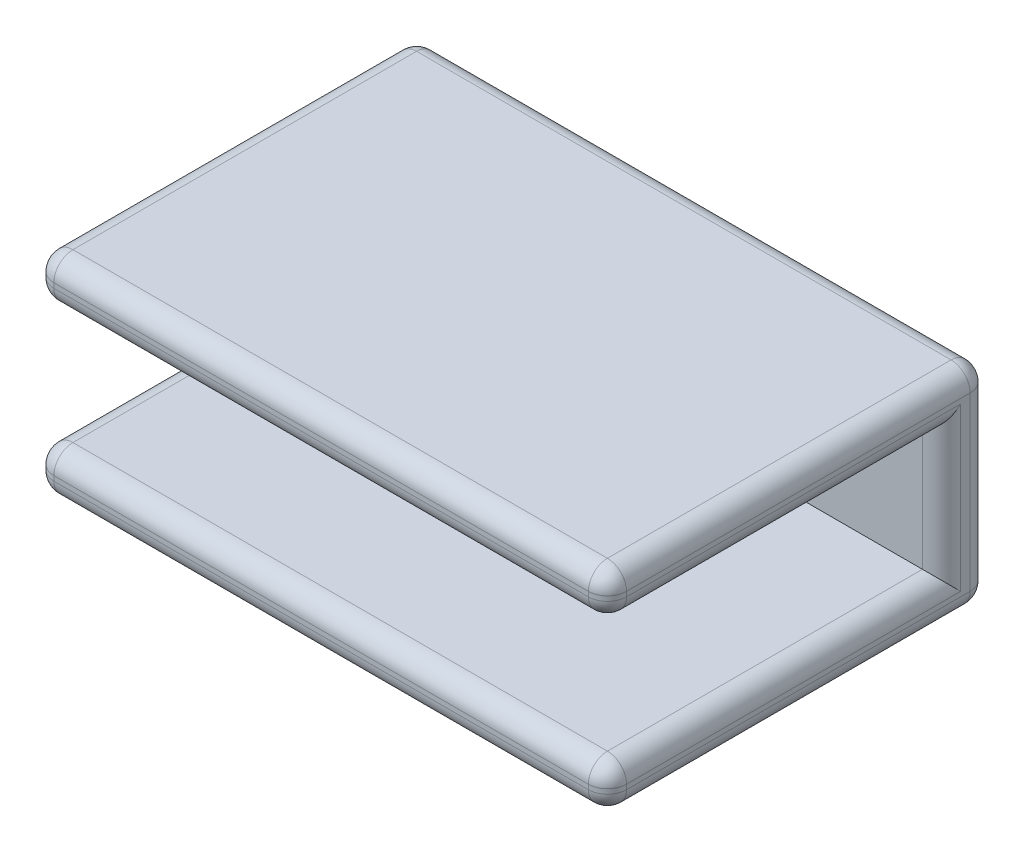
ISO-10303-21;
HEADER;
FILE_DESCRIPTION(('STEP AP214'),'2;1');
FILE_NAME('part.step','',(''),(''),'','','');
FILE_SCHEMA(('AUTOMOTIVE_DESIGN { 1 0 10303 214 1 1 1 1 }'));
ENDSEC;
DATA;
#1=APPLICATION_CONTEXT('core data for automotive mechanical design processes');
#2=APPLICATION_PROTOCOL_DEFINITION('international standard','automotive_design',2000,#1);
#3=PRODUCT_CONTEXT('',#1,'mechanical');
#4=PRODUCT('Part','Part','',(#3));
#5=PRODUCT_RELATED_PRODUCT_CATEGORY('part','',(#4));
#6=PRODUCT_DEFINITION_FORMATION('','',#4);
#7=PRODUCT_DEFINITION_CONTEXT('part definition',#1,'design');
#8=PRODUCT_DEFINITION('design','',#6,#7);
#9=PRODUCT_DEFINITION_SHAPE('','',#8);
#10=(LENGTH_UNIT() NAMED_UNIT(*) SI_UNIT(.MILLI.,.METRE.));
#11=(NAMED_UNIT(*) PLANE_ANGLE_UNIT() SI_UNIT($,.RADIAN.));
#12=(NAMED_UNIT(*) SI_UNIT($,.STERADIAN.) SOLID_ANGLE_UNIT());
#13=UNCERTAINTY_MEASURE_WITH_UNIT(LENGTH_MEASURE(1.E-05),#10,'distance_accuracy_value','');
#14=(GEOMETRIC_REPRESENTATION_CONTEXT(3) GLOBAL_UNCERTAINTY_ASSIGNED_CONTEXT((#13)) GLOBAL_UNIT_ASSIGNED_CONTEXT((#10,
#11,#12)) REPRESENTATION_CONTEXT('',''));
#15=CARTESIAN_POINT('',(0.,0.,0.));
#16=DIRECTION('',(0.,0.,1.));
#17=DIRECTION('',(1.,0.,0.));
#18=AXIS2_PLACEMENT_3D('',#15,#16,#17);
#19=CARTESIAN_POINT('',(-15.,11.,10.));
#20=DIRECTION('',(0.,0.,-1.));
#21=DIRECTION('',(-1.,0.,0.));
#22=AXIS2_PLACEMENT_3D('',#19,#20,#21);
#23=PLANE('',#22);
#24=DIRECTION('',(1.,0.,0.));
#25=VECTOR('',#24,1.);
#26=CARTESIAN_POINT('',(-15.,10.,10.));
#27=LINE('',#26,#25);
#28=CARTESIAN_POINT('',(14.,10.,10.));
#29=VERTEX_POINT('',#28);
#30=CARTESIAN_POINT('',(-14.,10.,10.));
#31=VERTEX_POINT('',#30);
#32=EDGE_CURVE('E322',#29,#31,#27,.F.);
#33=ORIENTED_EDGE('',*,*,#32,.T.);
#34=DIRECTION('',(0.,-1.,0.));
#35=VECTOR('',#34,1.);
#36=CARTESIAN_POINT('',(-14.,11.,10.));
#37=LINE('',#36,#35);
#38=CARTESIAN_POINT('',(-14.,9.75,10.));
#39=VERTEX_POINT('',#38);
#40=EDGE_CURVE('E325',#31,#39,#37,.T.);
#41=ORIENTED_EDGE('',*,*,#40,.T.);
#42=DIRECTION('',(-1.,0.,0.));
#43=VECTOR('',#42,1.);
#44=CARTESIAN_POINT('',(-15.,9.75,10.));
#45=LINE('',#44,#43);
#46=CARTESIAN_POINT('',(14.,9.75000000000001,10.));
#47=VERTEX_POINT('',#46);
#48=EDGE_CURVE('E320',#39,#47,#45,.F.);
#49=ORIENTED_EDGE('',*,*,#48,.T.);
#50=DIRECTION('',(0.,-1.,0.));
#51=VECTOR('',#50,1.);
#52=CARTESIAN_POINT('',(14.,11.,10.));
#53=LINE('',#52,#51);
#54=EDGE_CURVE('E318',#47,#29,#53,.F.);
#55=ORIENTED_EDGE('',*,*,#54,.T.);
#56=EDGE_LOOP('',(#33,#41,#49,#55));
#57=FACE_BOUND('',#56,.T.);
#58=ADVANCED_FACE('F33',(#57),#23,.F.);
#59=CARTESIAN_POINT('',(15.,11.,-10.));
#60=DIRECTION('',(-1.,0.,0.));
#61=DIRECTION('',(0.,0.,1.));
#62=AXIS2_PLACEMENT_3D('',#59,#60,#61);
#63=PLANE('',#62);
#64=DIRECTION('',(0.,-1.,0.));
#65=VECTOR('',#64,1.);
#66=CARTESIAN_POINT('',(15.,11.,-9.));
#67=LINE('',#66,#65);
#68=CARTESIAN_POINT('',(15.,1.,-9.));
#69=VERTEX_POINT('',#68);
#70=CARTESIAN_POINT('',(15.,10.,-9.));
#71=VERTEX_POINT('',#70);
#72=EDGE_CURVE('E42',#69,#71,#67,.F.);
#73=ORIENTED_EDGE('',*,*,#72,.T.);
#74=DIRECTION('',(0.,0.,-1.));
#75=VECTOR('',#74,1.);
#76=CARTESIAN_POINT('',(15.,10.,10.));
#77=LINE('',#76,#75);
#78=CARTESIAN_POINT('',(15.,10.,9.));
#79=VERTEX_POINT('',#78);
#80=EDGE_CURVE('E11',#71,#79,#77,.F.);
#81=ORIENTED_EDGE('',*,*,#80,.T.);
#82=DIRECTION('',(0.,-1.,0.));
#83=VECTOR('',#82,1.);
#84=CARTESIAN_POINT('',(15.,11.,9.));
#85=LINE('',#84,#83);
#86=CARTESIAN_POINT('',(15.,9.75000000000001,9.));
#87=VERTEX_POINT('',#86);
#88=EDGE_CURVE('E388',#79,#87,#85,.T.);
#89=ORIENTED_EDGE('',*,*,#88,.T.);
#90=DIRECTION('',(0.,0.,1.));
#91=VECTOR('',#90,1.);
#92=CARTESIAN_POINT('',(15.,9.75000000000001,-10.));
#93=LINE('',#92,#91);
#94=CARTESIAN_POINT('',(15.,9.75000000000001,-8.5));
#95=VERTEX_POINT('',#94);
#96=EDGE_CURVE('E390',#87,#95,#93,.F.);
#97=ORIENTED_EDGE('',*,*,#96,.T.);
#98=DIRECTION('',(0.,1.,0.));
#99=VECTOR('',#98,1.);
#100=CARTESIAN_POINT('',(15.,11.,-8.5));
#101=LINE('',#100,#99);
#102=CARTESIAN_POINT('',(15.,1.25,-8.5));
#103=VERTEX_POINT('',#102);
#104=EDGE_CURVE('E392',#95,#103,#101,.F.);
#105=ORIENTED_EDGE('',*,*,#104,.T.);
#106=DIRECTION('',(0.,0.,1.));
#107=VECTOR('',#106,1.);
#108=CARTESIAN_POINT('',(15.,1.25,-10.));
#109=LINE('',#108,#107);
#110=CARTESIAN_POINT('',(15.,1.25,9.));
#111=VERTEX_POINT('',#110);
#112=EDGE_CURVE('E394',#103,#111,#109,.T.);
#113=ORIENTED_EDGE('',*,*,#112,.T.);
#114=DIRECTION('',(0.,-1.,0.));
#115=VECTOR('',#114,1.);
#116=CARTESIAN_POINT('',(15.,11.,9.));
#117=LINE('',#116,#115);
#118=CARTESIAN_POINT('',(15.,1.,9.));
#119=VERTEX_POINT('',#118);
#120=EDGE_CURVE('E396',#111,#119,#117,.T.);
#121=ORIENTED_EDGE('',*,*,#120,.T.);
#122=DIRECTION('',(0.,0.,-1.));
#123=VECTOR('',#122,1.);
#124=CARTESIAN_POINT('',(15.,1.,-10.));
#125=LINE('',#124,#123);
#126=EDGE_CURVE('E53',#119,#69,#125,.T.);
#127=ORIENTED_EDGE('',*,*,#126,.T.);
#128=EDGE_LOOP('',(#73,#81,#89,#97,#105,#113,#121,#127));
#129=FACE_BOUND('',#128,.T.);
#130=ADVANCED_FACE('F437',(#129),#63,.F.);
#131=CARTESIAN_POINT('',(-15.,11.,-10.));
#132=DIRECTION('',(0.,0.,1.));
#133=DIRECTION('',(1.,0.,0.));
#134=AXIS2_PLACEMENT_3D('',#131,#132,#133);
#135=PLANE('',#134);
#136=DIRECTION('',(0.,-1.,0.));
#137=VECTOR('',#136,1.);
#138=CARTESIAN_POINT('',(14.,11.,-10.));
#139=LINE('',#138,#137);
#140=CARTESIAN_POINT('',(14.,10.,-10.));
#141=VERTEX_POINT('',#140);
#142=CARTESIAN_POINT('',(14.,1.,-10.));
#143=VERTEX_POINT('',#142);
#144=EDGE_CURVE('E377',#141,#143,#139,.T.);
#145=ORIENTED_EDGE('',*,*,#144,.T.);
#146=DIRECTION('',(-1.,0.,0.));
#147=VECTOR('',#146,1.);
#148=CARTESIAN_POINT('',(-15.,1.,-10.));
#149=LINE('',#148,#147);
#150=CARTESIAN_POINT('',(-14.,1.,-10.));
#151=VERTEX_POINT('',#150);
#152=EDGE_CURVE('E382',#143,#151,#149,.T.);
#153=ORIENTED_EDGE('',*,*,#152,.T.);
#154=DIRECTION('',(0.,-1.,0.));
#155=VECTOR('',#154,1.);
#156=CARTESIAN_POINT('',(-14.,11.,-10.));
#157=LINE('',#156,#155);
#158=CARTESIAN_POINT('',(-14.,10.,-10.));
#159=VERTEX_POINT('',#158);
#160=EDGE_CURVE('E379',#151,#159,#157,.F.);
#161=ORIENTED_EDGE('',*,*,#160,.T.);
#162=DIRECTION('',(-1.,0.,0.));
#163=VECTOR('',#162,1.);
#164=CARTESIAN_POINT('',(15.,10.,-10.));
#165=LINE('',#164,#163);
#166=EDGE_CURVE('E375',#159,#141,#165,.F.);
#167=ORIENTED_EDGE('',*,*,#166,.T.);
#168=EDGE_LOOP('',(#145,#153,#161,#167));
#169=FACE_BOUND('',#168,.T.);
#170=ADVANCED_FACE('F439',(#169),#135,.F.);
#171=CARTESIAN_POINT('',(-15.,11.,-10.));
#172=DIRECTION('',(1.,0.,0.));
#173=DIRECTION('',(0.,0.,-1.));
#174=AXIS2_PLACEMENT_3D('',#171,#172,#173);
#175=PLANE('',#174);
#176=DIRECTION('',(0.,-1.,0.));
#177=VECTOR('',#176,1.);
#178=CARTESIAN_POINT('',(-15.,11.,9.));
#179=LINE('',#178,#177);
#180=CARTESIAN_POINT('',(-15.,1.,9.));
#181=VERTEX_POINT('',#180);
#182=CARTESIAN_POINT('',(-15.,1.25,9.));
#183=VERTEX_POINT('',#182);
#184=EDGE_CURVE('E370',#181,#183,#179,.F.);
#185=ORIENTED_EDGE('',*,*,#184,.T.);
#186=DIRECTION('',(0.,0.,1.));
#187=VECTOR('',#186,1.);
#188=CARTESIAN_POINT('',(-15.,1.25,-10.));
#189=LINE('',#188,#187);
#190=CARTESIAN_POINT('',(-15.,1.25,-8.5));
#191=VERTEX_POINT('',#190);
#192=EDGE_CURVE('E372',#183,#191,#189,.F.);
#193=ORIENTED_EDGE('',*,*,#192,.T.);
#194=DIRECTION('',(0.,-1.,0.));
#195=VECTOR('',#194,1.);
#196=CARTESIAN_POINT('',(-15.,11.,-8.5));
#197=LINE('',#196,#195);
#198=CARTESIAN_POINT('',(-15.,9.75,-8.5));
#199=VERTEX_POINT('',#198);
#200=EDGE_CURVE('E358',#191,#199,#197,.F.);
#201=ORIENTED_EDGE('',*,*,#200,.T.);
#202=DIRECTION('',(0.,0.,1.));
#203=VECTOR('',#202,1.);
#204=CARTESIAN_POINT('',(-15.,9.75,-10.));
#205=LINE('',#204,#203);
#206=CARTESIAN_POINT('',(-15.,9.75,9.));
#207=VERTEX_POINT('',#206);
#208=EDGE_CURVE('E360',#199,#207,#205,.T.);
#209=ORIENTED_EDGE('',*,*,#208,.T.);
#210=DIRECTION('',(0.,-1.,0.));
#211=VECTOR('',#210,1.);
#212=CARTESIAN_POINT('',(-15.,11.,9.));
#213=LINE('',#212,#211);
#214=CARTESIAN_POINT('',(-15.,10.,9.));
#215=VERTEX_POINT('',#214);
#216=EDGE_CURVE('E362',#207,#215,#213,.F.);
#217=ORIENTED_EDGE('',*,*,#216,.T.);
#218=DIRECTION('',(0.,0.,1.));
#219=VECTOR('',#218,1.);
#220=CARTESIAN_POINT('',(-15.,10.,-10.));
#221=LINE('',#220,#219);
#222=CARTESIAN_POINT('',(-15.,10.,-9.));
#223=VERTEX_POINT('',#222);
#224=EDGE_CURVE('E364',#215,#223,#221,.F.);
#225=ORIENTED_EDGE('',*,*,#224,.T.);
#226=DIRECTION('',(0.,-1.,0.));
#227=VECTOR('',#226,1.);
#228=CARTESIAN_POINT('',(-15.,11.,-9.));
#229=LINE('',#228,#227);
#230=CARTESIAN_POINT('',(-15.,1.,-9.));
#231=VERTEX_POINT('',#230);
#232=EDGE_CURVE('E366',#223,#231,#229,.T.);
#233=ORIENTED_EDGE('',*,*,#232,.T.);
#234=DIRECTION('',(0.,0.,1.));
#235=VECTOR('',#234,1.);
#236=CARTESIAN_POINT('',(-15.,1.,-10.));
#237=LINE('',#236,#235);
#238=EDGE_CURVE('E368',#231,#181,#237,.T.);
#239=ORIENTED_EDGE('',*,*,#238,.T.);
#240=EDGE_LOOP('',(#185,#193,#201,#209,#217,#225,#233,#239));
#241=FACE_BOUND('',#240,.T.);
#242=ADVANCED_FACE('F445',(#241),#175,.F.);
#243=DIRECTION('',(1.,0.,0.));
#244=VECTOR('',#243,1.);
#245=CARTESIAN_POINT('',(-15.,1.25,10.));
#246=LINE('',#245,#244);
#247=CARTESIAN_POINT('',(14.,1.25,10.));
#248=VERTEX_POINT('',#247);
#249=CARTESIAN_POINT('',(-14.,1.25,10.));
#250=VERTEX_POINT('',#249);
#251=EDGE_CURVE('E336',#248,#250,#246,.F.);
#252=ORIENTED_EDGE('',*,*,#251,.T.);
#253=DIRECTION('',(0.,-1.,0.));
#254=VECTOR('',#253,1.);
#255=CARTESIAN_POINT('',(-14.,11.,10.));
#256=LINE('',#255,#254);
#257=CARTESIAN_POINT('',(-14.,1.,10.));
#258=VERTEX_POINT('',#257);
#259=EDGE_CURVE('E341',#250,#258,#256,.T.);
#260=ORIENTED_EDGE('',*,*,#259,.T.);
#261=DIRECTION('',(1.,0.,0.));
#262=VECTOR('',#261,1.);
#263=CARTESIAN_POINT('',(-15.,1.,10.));
#264=LINE('',#263,#262);
#265=CARTESIAN_POINT('',(14.,1.,10.));
#266=VERTEX_POINT('',#265);
#267=EDGE_CURVE('E338',#258,#266,#264,.T.);
#268=ORIENTED_EDGE('',*,*,#267,.T.);
#269=DIRECTION('',(0.,-1.,0.));
#270=VECTOR('',#269,1.);
#271=CARTESIAN_POINT('',(14.,11.,10.));
#272=LINE('',#271,#270);
#273=EDGE_CURVE('E334',#266,#248,#272,.F.);
#274=ORIENTED_EDGE('',*,*,#273,.T.);
#275=EDGE_LOOP('',(#252,#260,#268,#274));
#276=FACE_BOUND('',#275,.T.);
#277=ADVANCED_FACE('F449',(#276),#23,.F.);
#278=CARTESIAN_POINT('',(0.,11.,0.));
#279=DIRECTION('',(0.,1.,0.));
#280=DIRECTION('',(0.,0.,1.));
#281=AXIS2_PLACEMENT_3D('',#278,#279,#280);
#282=PLANE('',#281);
#283=DIRECTION('',(0.,0.,1.));
#284=VECTOR('',#283,1.);
#285=CARTESIAN_POINT('',(-14.,11.,10.));
#286=LINE('',#285,#284);
#287=CARTESIAN_POINT('',(-14.,11.,-9.));
#288=VERTEX_POINT('',#287);
#289=CARTESIAN_POINT('',(-14.,11.,9.));
#290=VERTEX_POINT('',#289);
#291=EDGE_CURVE('E192',#288,#290,#286,.T.);
#292=ORIENTED_EDGE('',*,*,#291,.T.);
#293=DIRECTION('',(1.,0.,0.));
#294=VECTOR('',#293,1.);
#295=CARTESIAN_POINT('',(15.,11.,9.));
#296=LINE('',#295,#294);
#297=CARTESIAN_POINT('',(14.,11.,9.));
#298=VERTEX_POINT('',#297);
#299=EDGE_CURVE('E188',#290,#298,#296,.T.);
#300=ORIENTED_EDGE('',*,*,#299,.T.);
#301=DIRECTION('',(0.,0.,-1.));
#302=VECTOR('',#301,1.);
#303=CARTESIAN_POINT('',(14.,11.,-10.));
#304=LINE('',#303,#302);
#305=CARTESIAN_POINT('',(14.,11.,-9.));
#306=VERTEX_POINT('',#305);
#307=EDGE_CURVE('E182',#298,#306,#304,.T.);
#308=ORIENTED_EDGE('',*,*,#307,.T.);
#309=DIRECTION('',(-1.,0.,0.));
#310=VECTOR('',#309,1.);
#311=CARTESIAN_POINT('',(-15.,11.,-9.));
#312=LINE('',#311,#310);
#313=EDGE_CURVE('E185',#306,#288,#312,.T.);
#314=ORIENTED_EDGE('',*,*,#313,.T.);
#315=EDGE_LOOP('',(#292,#300,#308,#314));
#316=FACE_BOUND('',#315,.T.);
#317=ADVANCED_FACE('F184',(#316),#282,.T.);
#318=CARTESIAN_POINT('',(0.,0.,0.));
#319=DIRECTION('',(0.,1.,0.));
#320=DIRECTION('',(0.,0.,1.));
#321=AXIS2_PLACEMENT_3D('',#318,#319,#320);
#322=PLANE('',#321);
#323=DIRECTION('',(0.,0.,-1.));
#324=VECTOR('',#323,1.);
#325=CARTESIAN_POINT('',(14.,0.,0.));
#326=LINE('',#325,#324);
#327=CARTESIAN_POINT('',(14.,0.,-9.));
#328=VERTEX_POINT('',#327);
#329=CARTESIAN_POINT('',(14.,0.,9.));
#330=VERTEX_POINT('',#329);
#331=EDGE_CURVE('E345',#328,#330,#326,.F.);
#332=ORIENTED_EDGE('',*,*,#331,.T.);
#333=DIRECTION('',(1.,0.,0.));
#334=VECTOR('',#333,1.);
#335=CARTESIAN_POINT('',(0.,0.,9.));
#336=LINE('',#335,#334);
#337=CARTESIAN_POINT('',(-14.,0.,9.));
#338=VERTEX_POINT('',#337);
#339=EDGE_CURVE('E349',#330,#338,#336,.F.);
#340=ORIENTED_EDGE('',*,*,#339,.T.);
#341=DIRECTION('',(0.,0.,1.));
#342=VECTOR('',#341,1.);
#343=CARTESIAN_POINT('',(-14.,0.,0.));
#344=LINE('',#343,#342);
#345=CARTESIAN_POINT('',(-14.,0.,-9.));
#346=VERTEX_POINT('',#345);
#347=EDGE_CURVE('E347',#338,#346,#344,.F.);
#348=ORIENTED_EDGE('',*,*,#347,.T.);
#349=DIRECTION('',(-1.,0.,0.));
#350=VECTOR('',#349,1.);
#351=CARTESIAN_POINT('',(0.,0.,-9.));
#352=LINE('',#351,#350);
#353=EDGE_CURVE('E343',#346,#328,#352,.F.);
#354=ORIENTED_EDGE('',*,*,#353,.T.);
#355=EDGE_LOOP('',(#332,#340,#348,#354));
#356=FACE_BOUND('',#355,.T.);
#357=ADVANCED_FACE('F603',(#356),#322,.F.);
#358=CARTESIAN_POINT('',(-15.,8.75,-7.5));
#359=DIRECTION('',(0.,1.,0.));
#360=DIRECTION('',(-1.,0.,0.));
#361=AXIS2_PLACEMENT_3D('',#358,#359,#360);
#362=PLANE('',#361);
#363=DIRECTION('',(-1.,0.,0.));
#364=VECTOR('',#363,1.);
#365=CARTESIAN_POINT('',(-15.,8.75,9.));
#366=LINE('',#365,#364);
#367=CARTESIAN_POINT('',(14.,8.75000000000001,9.));
#368=VERTEX_POINT('',#367);
#369=CARTESIAN_POINT('',(-14.,8.75,9.));
#370=VERTEX_POINT('',#369);
#371=EDGE_CURVE('E329',#368,#370,#366,.T.);
#372=ORIENTED_EDGE('',*,*,#371,.T.);
#373=DIRECTION('',(0.,0.,1.));
#374=VECTOR('',#373,1.);
#375=CARTESIAN_POINT('',(-14.,8.75,-7.5));
#376=LINE('',#375,#374);
#377=CARTESIAN_POINT('',(-14.,8.75,-7.5));
#378=VERTEX_POINT('',#377);
#379=EDGE_CURVE('E332',#370,#378,#376,.F.);
#380=ORIENTED_EDGE('',*,*,#379,.T.);
#381=DIRECTION('',(-1.,0.,0.));
#382=VECTOR('',#381,1.);
#383=CARTESIAN_POINT('',(-15.,8.75,-7.5));
#384=LINE('',#383,#382);
#385=CARTESIAN_POINT('',(14.,8.75000000000001,-7.5));
#386=VERTEX_POINT('',#385);
#387=EDGE_CURVE('E306',#386,#378,#384,.T.);
#388=ORIENTED_EDGE('',*,*,#387,.F.);
#389=DIRECTION('',(0.,0.,1.));
#390=VECTOR('',#389,1.);
#391=CARTESIAN_POINT('',(14.,8.75000000000001,-7.50000000000001));
#392=LINE('',#391,#390);
#393=EDGE_CURVE('E327',#386,#368,#392,.T.);
#394=ORIENTED_EDGE('',*,*,#393,.T.);
#395=EDGE_LOOP('',(#372,#380,#388,#394));
#396=FACE_BOUND('',#395,.T.);
#397=ADVANCED_FACE('F617',(#396),#362,.F.);
#398=CARTESIAN_POINT('',(-15.,2.25,-7.5));
#399=DIRECTION('',(0.,-1.,0.));
#400=DIRECTION('',(0.,0.,-1.));
#401=AXIS2_PLACEMENT_3D('',#398,#399,#400);
#402=PLANE('',#401);
#403=DIRECTION('',(1.,0.,0.));
#404=VECTOR('',#403,1.);
#405=CARTESIAN_POINT('',(-15.,2.25,-7.5));
#406=LINE('',#405,#404);
#407=CARTESIAN_POINT('',(-14.,2.25,-7.5));
#408=VERTEX_POINT('',#407);
#409=CARTESIAN_POINT('',(14.,2.25,-7.5));
#410=VERTEX_POINT('',#409);
#411=EDGE_CURVE('E203',#408,#410,#406,.T.);
#412=ORIENTED_EDGE('',*,*,#411,.F.);
#413=DIRECTION('',(0.,0.,1.));
#414=VECTOR('',#413,1.);
#415=CARTESIAN_POINT('',(-14.,2.25,-7.5));
#416=LINE('',#415,#414);
#417=CARTESIAN_POINT('',(-14.,2.25,9.));
#418=VERTEX_POINT('',#417);
#419=EDGE_CURVE('E356',#408,#418,#416,.T.);
#420=ORIENTED_EDGE('',*,*,#419,.T.);
#421=DIRECTION('',(1.,0.,0.));
#422=VECTOR('',#421,1.);
#423=CARTESIAN_POINT('',(-15.,2.25,9.));
#424=LINE('',#423,#422);
#425=CARTESIAN_POINT('',(14.,2.25,9.));
#426=VERTEX_POINT('',#425);
#427=EDGE_CURVE('E354',#418,#426,#424,.T.);
#428=ORIENTED_EDGE('',*,*,#427,.T.);
#429=DIRECTION('',(0.,0.,1.));
#430=VECTOR('',#429,1.);
#431=CARTESIAN_POINT('',(14.,2.25,-7.50000000000001));
#432=LINE('',#431,#430);
#433=EDGE_CURVE('E352',#426,#410,#432,.F.);
#434=ORIENTED_EDGE('',*,*,#433,.T.);
#435=EDGE_LOOP('',(#412,#420,#428,#434));
#436=FACE_BOUND('',#435,.T.);
#437=ADVANCED_FACE('F589',(#436),#402,.F.);
#438=CARTESIAN_POINT('',(0.,0.,-7.5));
#439=DIRECTION('',(0.,0.,-1.));
#440=DIRECTION('',(-1.,0.,0.));
#441=AXIS2_PLACEMENT_3D('',#438,#439,#440);
#442=PLANE('',#441);
#443=ORIENTED_EDGE('',*,*,#387,.T.);
#444=DIRECTION('',(0.,-1.,0.));
#445=VECTOR('',#444,1.);
#446=CARTESIAN_POINT('',(-14.,0.,-7.5));
#447=LINE('',#446,#445);
#448=EDGE_CURVE('E386',#378,#408,#447,.T.);
#449=ORIENTED_EDGE('',*,*,#448,.T.);
#450=ORIENTED_EDGE('',*,*,#411,.T.);
#451=DIRECTION('',(0.,1.,0.));
#452=VECTOR('',#451,1.);
#453=CARTESIAN_POINT('',(14.,0.,-7.5));
#454=LINE('',#453,#452);
#455=EDGE_CURVE('E384',#410,#386,#454,.T.);
#456=ORIENTED_EDGE('',*,*,#455,.T.);
#457=EDGE_LOOP('',(#443,#449,#450,#456));
#458=FACE_BOUND('',#457,.T.);
#459=ADVANCED_FACE('F568',(#458),#442,.F.);
#460=CARTESIAN_POINT('',(-14.,11.,9.));
#461=DIRECTION('',(0.,-1.,0.));
#462=DIRECTION('',(0.,0.,-1.));
#463=AXIS2_PLACEMENT_3D('',#460,#461,#462);
#464=CYLINDRICAL_SURFACE('',#463,1.);
#465=CARTESIAN_POINT('',(-14.,1.,9.));
#466=DIRECTION('',(0.,-1.,0.));
#467=DIRECTION('',(0.,0.,-1.));
#468=AXIS2_PLACEMENT_3D('',#465,#466,#467);
#469=CIRCLE('',#468,1.);
#470=EDGE_CURVE('E298',#258,#181,#469,.T.);
#471=ORIENTED_EDGE('',*,*,#470,.F.);
#472=ORIENTED_EDGE('',*,*,#259,.F.);
#473=CARTESIAN_POINT('',(-14.,1.25,9.));
#474=DIRECTION('',(0.,1.,0.));
#475=DIRECTION('',(0.,0.,1.));
#476=AXIS2_PLACEMENT_3D('',#473,#474,#475);
#477=CIRCLE('',#476,1.);
#478=EDGE_CURVE('E300',#183,#250,#477,.T.);
#479=ORIENTED_EDGE('',*,*,#478,.F.);
#480=ORIENTED_EDGE('',*,*,#184,.F.);
#481=EDGE_LOOP('',(#471,#472,#479,#480));
#482=FACE_BOUND('',#481,.T.);
#483=ADVANCED_FACE('F35',(#482),#464,.T.);
#484=CARTESIAN_POINT('',(-15.,1.,9.));
#485=DIRECTION('',(1.,0.,0.));
#486=DIRECTION('',(0.,0.,-1.));
#487=AXIS2_PLACEMENT_3D('',#484,#485,#486);
#488=CYLINDRICAL_SURFACE('',#487,1.);
#489=CARTESIAN_POINT('',(14.,1.,9.));
#490=DIRECTION('',(1.,0.,0.));
#491=DIRECTION('',(0.,0.,-1.));
#492=AXIS2_PLACEMENT_3D('',#489,#490,#491);
#493=CIRCLE('',#492,1.);
#494=EDGE_CURVE('E292',#266,#330,#493,.T.);
#495=ORIENTED_EDGE('',*,*,#494,.F.);
#496=ORIENTED_EDGE('',*,*,#267,.F.);
#497=CARTESIAN_POINT('',(-14.,1.,9.));
#498=DIRECTION('',(-1.,0.,0.));
#499=DIRECTION('',(0.,0.,1.));
#500=AXIS2_PLACEMENT_3D('',#497,#498,#499);
#501=CIRCLE('',#500,1.);
#502=EDGE_CURVE('E295',#338,#258,#501,.T.);
#503=ORIENTED_EDGE('',*,*,#502,.F.);
#504=ORIENTED_EDGE('',*,*,#339,.F.);
#505=EDGE_LOOP('',(#495,#496,#503,#504));
#506=FACE_BOUND('',#505,.T.);
#507=ADVANCED_FACE('F561',(#506),#488,.T.);
#508=CARTESIAN_POINT('',(14.,11.,9.));
#509=DIRECTION('',(0.,-1.,0.));
#510=DIRECTION('',(0.,0.,-1.));
#511=AXIS2_PLACEMENT_3D('',#508,#509,#510);
#512=CYLINDRICAL_SURFACE('',#511,1.);
#513=CARTESIAN_POINT('',(14.,1.25,9.));
#514=DIRECTION('',(0.,1.,0.));
#515=DIRECTION('',(-1.,0.,0.));
#516=AXIS2_PLACEMENT_3D('',#513,#514,#515);
#517=CIRCLE('',#516,1.);
#518=EDGE_CURVE('E287',#248,#111,#517,.T.);
#519=ORIENTED_EDGE('',*,*,#518,.F.);
#520=ORIENTED_EDGE('',*,*,#273,.F.);
#521=CARTESIAN_POINT('',(14.,1.,9.));
#522=DIRECTION('',(0.,-1.,0.));
#523=DIRECTION('',(0.,0.,-1.));
#524=AXIS2_PLACEMENT_3D('',#521,#522,#523);
#525=CIRCLE('',#524,1.);
#526=EDGE_CURVE('E290',#119,#266,#525,.T.);
#527=ORIENTED_EDGE('',*,*,#526,.F.);
#528=ORIENTED_EDGE('',*,*,#120,.F.);
#529=EDGE_LOOP('',(#519,#520,#527,#528));
#530=FACE_BOUND('',#529,.T.);
#531=ADVANCED_FACE('F558',(#530),#512,.T.);
#532=CARTESIAN_POINT('',(-15.,1.25,9.));
#533=DIRECTION('',(1.,0.,0.));
#534=DIRECTION('',(0.,0.,-1.));
#535=AXIS2_PLACEMENT_3D('',#532,#533,#534);
#536=CYLINDRICAL_SURFACE('',#535,1.);
#537=CARTESIAN_POINT('',(-14.,1.25,9.));
#538=DIRECTION('',(-1.,0.,0.));
#539=DIRECTION('',(0.,0.,1.));
#540=AXIS2_PLACEMENT_3D('',#537,#538,#539);
#541=CIRCLE('',#540,1.);
#542=EDGE_CURVE('E37',#250,#418,#541,.T.);
#543=ORIENTED_EDGE('',*,*,#542,.F.);
#544=ORIENTED_EDGE('',*,*,#251,.F.);
#545=CARTESIAN_POINT('',(14.,1.25,9.));
#546=DIRECTION('',(1.,0.,0.));
#547=DIRECTION('',(0.,0.,-1.));
#548=AXIS2_PLACEMENT_3D('',#545,#546,#547);
#549=CIRCLE('',#548,1.);
#550=EDGE_CURVE('E284',#426,#248,#549,.T.);
#551=ORIENTED_EDGE('',*,*,#550,.F.);
#552=ORIENTED_EDGE('',*,*,#427,.F.);
#553=EDGE_LOOP('',(#543,#544,#551,#552));
#554=FACE_BOUND('',#553,.T.);
#555=ADVANCED_FACE('F555',(#554),#536,.T.);
#556=CARTESIAN_POINT('',(-14.,1.25,9.));
#557=DIRECTION('',(0.,0.,1.));
#558=DIRECTION('',(1.,0.,0.));
#559=AXIS2_PLACEMENT_3D('',#556,#557,#558);
#560=SPHERICAL_SURFACE('',#559,1.);
#561=ORIENTED_EDGE('',*,*,#478,.T.);
#562=ORIENTED_EDGE('',*,*,#542,.T.);
#563=CARTESIAN_POINT('',(-14.,1.25,9.));
#564=DIRECTION('',(0.,0.,1.));
#565=DIRECTION('',(1.,0.,0.));
#566=AXIS2_PLACEMENT_3D('',#563,#564,#565);
#567=CIRCLE('',#566,1.);
#568=EDGE_CURVE('E281',#183,#418,#567,.F.);
#569=ORIENTED_EDGE('',*,*,#568,.F.);
#570=EDGE_LOOP('',(#561,#562,#569));
#571=FACE_BOUND('',#570,.T.);
#572=ADVANCED_FACE('F551',(#571),#560,.T.);
#573=CARTESIAN_POINT('',(-14.,1.,9.));
#574=DIRECTION('',(0.,0.,1.));
#575=DIRECTION('',(1.,0.,0.));
#576=AXIS2_PLACEMENT_3D('',#573,#574,#575);
#577=SPHERICAL_SURFACE('',#576,1.);
#578=ORIENTED_EDGE('',*,*,#502,.T.);
#579=ORIENTED_EDGE('',*,*,#470,.T.);
#580=CARTESIAN_POINT('',(-14.,1.,9.));
#581=DIRECTION('',(0.,0.,1.));
#582=DIRECTION('',(1.,0.,0.));
#583=AXIS2_PLACEMENT_3D('',#580,#581,#582);
#584=CIRCLE('',#583,1.);
#585=EDGE_CURVE('E278',#338,#181,#584,.F.);
#586=ORIENTED_EDGE('',*,*,#585,.F.);
#587=EDGE_LOOP('',(#578,#579,#586));
#588=FACE_BOUND('',#587,.T.);
#589=ADVANCED_FACE('F547',(#588),#577,.T.);
#590=CARTESIAN_POINT('',(14.,1.,9.));
#591=DIRECTION('',(0.,0.,1.));
#592=DIRECTION('',(1.,0.,0.));
#593=AXIS2_PLACEMENT_3D('',#590,#591,#592);
#594=SPHERICAL_SURFACE('',#593,1.);
#595=ORIENTED_EDGE('',*,*,#526,.T.);
#596=ORIENTED_EDGE('',*,*,#494,.T.);
#597=CARTESIAN_POINT('',(14.,1.,9.));
#598=DIRECTION('',(0.,0.,1.));
#599=DIRECTION('',(1.,0.,0.));
#600=AXIS2_PLACEMENT_3D('',#597,#598,#599);
#601=CIRCLE('',#600,1.);
#602=EDGE_CURVE('E275',#119,#330,#601,.F.);
#603=ORIENTED_EDGE('',*,*,#602,.F.);
#604=EDGE_LOOP('',(#595,#596,#603));
#605=FACE_BOUND('',#604,.T.);
#606=ADVANCED_FACE('F543',(#605),#594,.T.);
#607=CARTESIAN_POINT('',(14.,1.25,9.));
#608=DIRECTION('',(0.,0.,1.));
#609=DIRECTION('',(1.,0.,0.));
#610=AXIS2_PLACEMENT_3D('',#607,#608,#609);
#611=SPHERICAL_SURFACE('',#610,1.);
#612=ORIENTED_EDGE('',*,*,#550,.T.);
#613=ORIENTED_EDGE('',*,*,#518,.T.);
#614=CARTESIAN_POINT('',(14.,1.25,9.));
#615=DIRECTION('',(0.,0.,1.));
#616=DIRECTION('',(1.,0.,0.));
#617=AXIS2_PLACEMENT_3D('',#614,#615,#616);
#618=CIRCLE('',#617,1.);
#619=EDGE_CURVE('E272',#426,#111,#618,.F.);
#620=ORIENTED_EDGE('',*,*,#619,.F.);
#621=EDGE_LOOP('',(#612,#613,#620));
#622=FACE_BOUND('',#621,.T.);
#623=ADVANCED_FACE('F539',(#622),#611,.T.);
#624=CARTESIAN_POINT('',(-14.,1.25,-7.5));
#625=DIRECTION('',(0.,0.,1.));
#626=DIRECTION('',(1.,0.,0.));
#627=AXIS2_PLACEMENT_3D('',#624,#625,#626);
#628=CYLINDRICAL_SURFACE('',#627,1.);
#629=ORIENTED_EDGE('',*,*,#568,.T.);
#630=ORIENTED_EDGE('',*,*,#419,.F.);
#631=CARTESIAN_POINT('',(-14.,1.25,-8.5));
#632=DIRECTION('',(0.,-0.707106781186547,0.707106781186547));
#633=DIRECTION('',(0.,0.707106781186547,0.707106781186547));
#634=AXIS2_PLACEMENT_3D('',#631,#632,#633);
#635=ELLIPSE('',#634,1.41421356237309,1.);
#636=EDGE_CURVE('E269',#191,#408,#635,.F.);
#637=ORIENTED_EDGE('',*,*,#636,.F.);
#638=ORIENTED_EDGE('',*,*,#192,.F.);
#639=EDGE_LOOP('',(#629,#630,#637,#638));
#640=FACE_BOUND('',#639,.T.);
#641=ADVANCED_FACE('F535',(#640),#628,.T.);
#642=CARTESIAN_POINT('',(-14.,1.,-10.));
#643=DIRECTION('',(0.,0.,1.));
#644=DIRECTION('',(1.,0.,0.));
#645=AXIS2_PLACEMENT_3D('',#642,#643,#644);
#646=CYLINDRICAL_SURFACE('',#645,1.);
#647=ORIENTED_EDGE('',*,*,#585,.T.);
#648=ORIENTED_EDGE('',*,*,#238,.F.);
#649=CARTESIAN_POINT('',(-14.,1.,-9.));
#650=DIRECTION('',(0.,0.,-1.));
#651=DIRECTION('',(-1.,0.,0.));
#652=AXIS2_PLACEMENT_3D('',#649,#650,#651);
#653=CIRCLE('',#652,1.);
#654=EDGE_CURVE('E266',#346,#231,#653,.T.);
#655=ORIENTED_EDGE('',*,*,#654,.F.);
#656=ORIENTED_EDGE('',*,*,#347,.F.);
#657=EDGE_LOOP('',(#647,#648,#655,#656));
#658=FACE_BOUND('',#657,.T.);
#659=ADVANCED_FACE('F531',(#658),#646,.T.);
#660=CARTESIAN_POINT('',(-15.,1.,-9.));
#661=DIRECTION('',(-1.,0.,0.));
#662=DIRECTION('',(0.,0.,1.));
#663=AXIS2_PLACEMENT_3D('',#660,#661,#662);
#664=CYLINDRICAL_SURFACE('',#663,1.);
#665=CARTESIAN_POINT('',(14.,1.,-9.));
#666=DIRECTION('',(1.,0.,0.));
#667=DIRECTION('',(0.,0.,-1.));
#668=AXIS2_PLACEMENT_3D('',#665,#666,#667);
#669=CIRCLE('',#668,1.);
#670=EDGE_CURVE('E260',#328,#143,#669,.T.);
#671=ORIENTED_EDGE('',*,*,#670,.F.);
#672=ORIENTED_EDGE('',*,*,#353,.F.);
#673=CARTESIAN_POINT('',(-14.,1.,-9.));
#674=DIRECTION('',(-1.,0.,0.));
#675=DIRECTION('',(0.,0.,1.));
#676=AXIS2_PLACEMENT_3D('',#673,#674,#675);
#677=CIRCLE('',#676,1.);
#678=EDGE_CURVE('E263',#151,#346,#677,.T.);
#679=ORIENTED_EDGE('',*,*,#678,.F.);
#680=ORIENTED_EDGE('',*,*,#152,.F.);
#681=EDGE_LOOP('',(#671,#672,#679,#680));
#682=FACE_BOUND('',#681,.T.);
#683=ADVANCED_FACE('F527',(#682),#664,.T.);
#684=CARTESIAN_POINT('',(14.,1.,-10.));
#685=DIRECTION('',(0.,0.,-1.));
#686=DIRECTION('',(-1.,0.,0.));
#687=AXIS2_PLACEMENT_3D('',#684,#685,#686);
#688=CYLINDRICAL_SURFACE('',#687,1.);
#689=ORIENTED_EDGE('',*,*,#602,.T.);
#690=ORIENTED_EDGE('',*,*,#331,.F.);
#691=CARTESIAN_POINT('',(14.,1.,-9.));
#692=DIRECTION('',(0.,0.,-1.));
#693=DIRECTION('',(-1.,0.,0.));
#694=AXIS2_PLACEMENT_3D('',#691,#692,#693);
#695=CIRCLE('',#694,1.);
#696=EDGE_CURVE('E257',#69,#328,#695,.T.);
#697=ORIENTED_EDGE('',*,*,#696,.F.);
#698=ORIENTED_EDGE('',*,*,#126,.F.);
#699=EDGE_LOOP('',(#689,#690,#697,#698));
#700=FACE_BOUND('',#699,.T.);
#701=ADVANCED_FACE('F523',(#700),#688,.T.);
#702=CARTESIAN_POINT('',(14.,1.25,-10.));
#703=DIRECTION('',(0.,0.,1.));
#704=DIRECTION('',(1.,0.,0.));
#705=AXIS2_PLACEMENT_3D('',#702,#703,#704);
#706=CYLINDRICAL_SURFACE('',#705,1.);
#707=ORIENTED_EDGE('',*,*,#619,.T.);
#708=ORIENTED_EDGE('',*,*,#112,.F.);
#709=CARTESIAN_POINT('',(14.,1.25,-8.5));
#710=DIRECTION('',(0.,-0.707106781186547,0.707106781186547));
#711=DIRECTION('',(0.,0.707106781186547,0.707106781186547));
#712=AXIS2_PLACEMENT_3D('',#709,#710,#711);
#713=ELLIPSE('',#712,1.41421356237309,1.);
#714=EDGE_CURVE('E254',#410,#103,#713,.F.);
#715=ORIENTED_EDGE('',*,*,#714,.F.);
#716=ORIENTED_EDGE('',*,*,#433,.F.);
#717=EDGE_LOOP('',(#707,#708,#715,#716));
#718=FACE_BOUND('',#717,.T.);
#719=ADVANCED_FACE('F519',(#718),#706,.T.);
#720=CARTESIAN_POINT('',(-14.,0.,-8.5));
#721=DIRECTION('',(0.,-1.,0.));
#722=DIRECTION('',(0.,0.,-1.));
#723=AXIS2_PLACEMENT_3D('',#720,#721,#722);
#724=CYLINDRICAL_SURFACE('',#723,1.);
#725=ORIENTED_EDGE('',*,*,#636,.T.);
#726=ORIENTED_EDGE('',*,*,#448,.F.);
#727=CARTESIAN_POINT('',(-14.,9.75,-8.5));
#728=DIRECTION('',(0.,0.707106781186547,0.707106781186547));
#729=DIRECTION('',(0.,-0.707106781186547,0.707106781186547));
#730=AXIS2_PLACEMENT_3D('',#727,#728,#729);
#731=ELLIPSE('',#730,1.41421356237309,1.);
#732=EDGE_CURVE('E251',#199,#378,#731,.T.);
#733=ORIENTED_EDGE('',*,*,#732,.F.);
#734=ORIENTED_EDGE('',*,*,#200,.F.);
#735=EDGE_LOOP('',(#725,#726,#733,#734));
#736=FACE_BOUND('',#735,.T.);
#737=ADVANCED_FACE('F515',(#736),#724,.T.);
#738=CARTESIAN_POINT('',(-14.,1.,-9.));
#739=DIRECTION('',(0.,0.,1.));
#740=DIRECTION('',(1.,0.,0.));
#741=AXIS2_PLACEMENT_3D('',#738,#739,#740);
#742=SPHERICAL_SURFACE('',#741,1.);
#743=ORIENTED_EDGE('',*,*,#678,.T.);
#744=ORIENTED_EDGE('',*,*,#654,.T.);
#745=CARTESIAN_POINT('',(-14.,1.,-9.));
#746=DIRECTION('',(0.,-1.,0.));
#747=DIRECTION('',(0.,0.,-1.));
#748=AXIS2_PLACEMENT_3D('',#745,#746,#747);
#749=CIRCLE('',#748,1.);
#750=EDGE_CURVE('E248',#151,#231,#749,.F.);
#751=ORIENTED_EDGE('',*,*,#750,.F.);
#752=EDGE_LOOP('',(#743,#744,#751));
#753=FACE_BOUND('',#752,.T.);
#754=ADVANCED_FACE('F511',(#753),#742,.T.);
#755=CARTESIAN_POINT('',(14.,1.,-9.));
#756=DIRECTION('',(0.,0.,1.));
#757=DIRECTION('',(1.,0.,0.));
#758=AXIS2_PLACEMENT_3D('',#755,#756,#757);
#759=SPHERICAL_SURFACE('',#758,1.);
#760=ORIENTED_EDGE('',*,*,#696,.T.);
#761=ORIENTED_EDGE('',*,*,#670,.T.);
#762=CARTESIAN_POINT('',(14.,1.,-9.));
#763=DIRECTION('',(0.,-1.,0.));
#764=DIRECTION('',(0.,0.,-1.));
#765=AXIS2_PLACEMENT_3D('',#762,#763,#764);
#766=CIRCLE('',#765,1.);
#767=EDGE_CURVE('E245',#69,#143,#766,.F.);
#768=ORIENTED_EDGE('',*,*,#767,.F.);
#769=EDGE_LOOP('',(#760,#761,#768));
#770=FACE_BOUND('',#769,.T.);
#771=ADVANCED_FACE('F507',(#770),#759,.T.);
#772=CARTESIAN_POINT('',(14.,0.,-8.5));
#773=DIRECTION('',(0.,1.,0.));
#774=DIRECTION('',(0.,0.,1.));
#775=AXIS2_PLACEMENT_3D('',#772,#773,#774);
#776=CYLINDRICAL_SURFACE('',#775,1.);
#777=ORIENTED_EDGE('',*,*,#714,.T.);
#778=ORIENTED_EDGE('',*,*,#104,.F.);
#779=CARTESIAN_POINT('',(14.,9.75000000000001,-8.5));
#780=DIRECTION('',(0.,0.707106781186547,0.707106781186547));
#781=DIRECTION('',(0.,0.707106781186547,-0.707106781186547));
#782=AXIS2_PLACEMENT_3D('',#779,#780,#781);
#783=ELLIPSE('',#782,1.41421356237309,1.);
#784=EDGE_CURVE('E242',#386,#95,#783,.T.);
#785=ORIENTED_EDGE('',*,*,#784,.F.);
#786=ORIENTED_EDGE('',*,*,#455,.F.);
#787=EDGE_LOOP('',(#777,#778,#785,#786));
#788=FACE_BOUND('',#787,.T.);
#789=ADVANCED_FACE('F503',(#788),#776,.T.);
#790=CARTESIAN_POINT('',(-14.,9.75,-10.));
#791=DIRECTION('',(0.,0.,1.));
#792=DIRECTION('',(1.,0.,0.));
#793=AXIS2_PLACEMENT_3D('',#790,#791,#792);
#794=CYLINDRICAL_SURFACE('',#793,1.);
#795=ORIENTED_EDGE('',*,*,#732,.T.);
#796=ORIENTED_EDGE('',*,*,#379,.F.);
#797=CARTESIAN_POINT('',(-14.,9.75,9.));
#798=DIRECTION('',(0.,0.,1.));
#799=DIRECTION('',(1.,0.,0.));
#800=AXIS2_PLACEMENT_3D('',#797,#798,#799);
#801=CIRCLE('',#800,1.);
#802=EDGE_CURVE('E237',#207,#370,#801,.T.);
#803=ORIENTED_EDGE('',*,*,#802,.F.);
#804=ORIENTED_EDGE('',*,*,#208,.F.);
#805=EDGE_LOOP('',(#795,#796,#803,#804));
#806=FACE_BOUND('',#805,.T.);
#807=ADVANCED_FACE('F499',(#806),#794,.T.);
#808=CARTESIAN_POINT('',(-14.,11.,-9.));
#809=DIRECTION('',(0.,-1.,0.));
#810=DIRECTION('',(0.,0.,-1.));
#811=AXIS2_PLACEMENT_3D('',#808,#809,#810);
#812=CYLINDRICAL_SURFACE('',#811,1.);
#813=ORIENTED_EDGE('',*,*,#750,.T.);
#814=ORIENTED_EDGE('',*,*,#232,.F.);
#815=CARTESIAN_POINT('',(-14.,10.,-9.));
#816=DIRECTION('',(0.,1.,0.));
#817=DIRECTION('',(0.,0.,1.));
#818=AXIS2_PLACEMENT_3D('',#815,#816,#817);
#819=CIRCLE('',#818,1.);
#820=EDGE_CURVE('E234',#159,#223,#819,.T.);
#821=ORIENTED_EDGE('',*,*,#820,.F.);
#822=ORIENTED_EDGE('',*,*,#160,.F.);
#823=EDGE_LOOP('',(#813,#814,#821,#822));
#824=FACE_BOUND('',#823,.T.);
#825=ADVANCED_FACE('F496',(#824),#812,.T.);
#826=CARTESIAN_POINT('',(0.,10.,-9.));
#827=DIRECTION('',(1.,0.,0.));
#828=DIRECTION('',(0.,0.,-1.));
#829=AXIS2_PLACEMENT_3D('',#826,#827,#828);
#830=CYLINDRICAL_SURFACE('',#829,1.);
#831=CARTESIAN_POINT('',(14.,10.,-9.));
#832=DIRECTION('',(1.,0.,0.));
#833=DIRECTION('',(0.,1.,0.));
#834=AXIS2_PLACEMENT_3D('',#831,#832,#833);
#835=CIRCLE('',#834,1.);
#836=EDGE_CURVE('E199',#141,#306,#835,.T.);
#837=ORIENTED_EDGE('',*,*,#836,.F.);
#838=ORIENTED_EDGE('',*,*,#166,.F.);
#839=CARTESIAN_POINT('',(-14.,10.,-9.));
#840=DIRECTION('',(-1.,0.,0.));
#841=DIRECTION('',(0.,0.,1.));
#842=AXIS2_PLACEMENT_3D('',#839,#840,#841);
#843=CIRCLE('',#842,1.);
#844=EDGE_CURVE('E201',#288,#159,#843,.T.);
#845=ORIENTED_EDGE('',*,*,#844,.F.);
#846=ORIENTED_EDGE('',*,*,#313,.F.);
#847=EDGE_LOOP('',(#837,#838,#845,#846));
#848=FACE_BOUND('',#847,.T.);
#849=ADVANCED_FACE('F197',(#848),#830,.T.);
#850=CARTESIAN_POINT('',(14.,11.,-9.));
#851=DIRECTION('',(0.,-1.,0.));
#852=DIRECTION('',(0.,0.,-1.));
#853=AXIS2_PLACEMENT_3D('',#850,#851,#852);
#854=CYLINDRICAL_SURFACE('',#853,1.);
#855=ORIENTED_EDGE('',*,*,#767,.T.);
#856=ORIENTED_EDGE('',*,*,#144,.F.);
#857=CARTESIAN_POINT('',(14.,10.,-9.));
#858=DIRECTION('',(0.,1.,0.));
#859=DIRECTION('',(0.,0.,1.));
#860=AXIS2_PLACEMENT_3D('',#857,#858,#859);
#861=CIRCLE('',#860,1.);
#862=EDGE_CURVE('E210',#71,#141,#861,.T.);
#863=ORIENTED_EDGE('',*,*,#862,.F.);
#864=ORIENTED_EDGE('',*,*,#72,.F.);
#865=EDGE_LOOP('',(#855,#856,#863,#864));
#866=FACE_BOUND('',#865,.T.);
#867=ADVANCED_FACE('F489',(#866),#854,.T.);
#868=CARTESIAN_POINT('',(14.,9.75000000000001,-7.50000000000001));
#869=DIRECTION('',(0.,0.,1.));
#870=DIRECTION('',(1.,0.,0.));
#871=AXIS2_PLACEMENT_3D('',#868,#869,#870);
#872=CYLINDRICAL_SURFACE('',#871,1.);
#873=ORIENTED_EDGE('',*,*,#784,.T.);
#874=ORIENTED_EDGE('',*,*,#96,.F.);
#875=CARTESIAN_POINT('',(14.,9.75000000000001,9.));
#876=DIRECTION('',(0.,0.,1.));
#877=DIRECTION('',(1.,0.,0.));
#878=AXIS2_PLACEMENT_3D('',#875,#876,#877);
#879=CIRCLE('',#878,1.);
#880=EDGE_CURVE('E229',#368,#87,#879,.T.);
#881=ORIENTED_EDGE('',*,*,#880,.F.);
#882=ORIENTED_EDGE('',*,*,#393,.F.);
#883=EDGE_LOOP('',(#873,#874,#881,#882));
#884=FACE_BOUND('',#883,.T.);
#885=ADVANCED_FACE('F485',(#884),#872,.T.);
#886=CARTESIAN_POINT('',(-15.,9.75,9.));
#887=DIRECTION('',(-1.,0.,0.));
#888=DIRECTION('',(0.,-1.,0.));
#889=AXIS2_PLACEMENT_3D('',#886,#887,#888);
#890=CYLINDRICAL_SURFACE('',#889,1.);
#891=CARTESIAN_POINT('',(-14.,9.75,9.));
#892=DIRECTION('',(-1.,0.,0.));
#893=DIRECTION('',(0.,0.,1.));
#894=AXIS2_PLACEMENT_3D('',#891,#892,#893);
#895=CIRCLE('',#894,1.);
#896=EDGE_CURVE('E239',#370,#39,#895,.T.);
#897=ORIENTED_EDGE('',*,*,#896,.F.);
#898=ORIENTED_EDGE('',*,*,#371,.F.);
#899=CARTESIAN_POINT('',(14.,9.75000000000001,9.));
#900=DIRECTION('',(1.,0.,0.));
#901=DIRECTION('',(0.,1.,0.));
#902=AXIS2_PLACEMENT_3D('',#899,#900,#901);
#903=CIRCLE('',#902,1.);
#904=EDGE_CURVE('E226',#47,#368,#903,.T.);
#905=ORIENTED_EDGE('',*,*,#904,.F.);
#906=ORIENTED_EDGE('',*,*,#48,.F.);
#907=EDGE_LOOP('',(#897,#898,#905,#906));
#908=FACE_BOUND('',#907,.T.);
#909=ADVANCED_FACE('F481',(#908),#890,.T.);
#910=CARTESIAN_POINT('',(-14.,9.75,9.));
#911=DIRECTION('',(0.,0.,1.));
#912=DIRECTION('',(1.,0.,0.));
#913=AXIS2_PLACEMENT_3D('',#910,#911,#912);
#914=SPHERICAL_SURFACE('',#913,1.);
#915=ORIENTED_EDGE('',*,*,#802,.T.);
#916=ORIENTED_EDGE('',*,*,#896,.T.);
#917=CARTESIAN_POINT('',(-14.,9.75,9.));
#918=DIRECTION('',(0.,-1.,0.));
#919=DIRECTION('',(0.,0.,-1.));
#920=AXIS2_PLACEMENT_3D('',#917,#918,#919);
#921=CIRCLE('',#920,1.);
#922=EDGE_CURVE('E217',#207,#39,#921,.F.);
#923=ORIENTED_EDGE('',*,*,#922,.F.);
#924=EDGE_LOOP('',(#915,#916,#923));
#925=FACE_BOUND('',#924,.T.);
#926=ADVANCED_FACE('F477',(#925),#914,.T.);
#927=CARTESIAN_POINT('',(-14.,10.,-9.));
#928=DIRECTION('',(0.,0.,1.));
#929=DIRECTION('',(1.,0.,0.));
#930=AXIS2_PLACEMENT_3D('',#927,#928,#929);
#931=SPHERICAL_SURFACE('',#930,1.);
#932=ORIENTED_EDGE('',*,*,#844,.T.);
#933=ORIENTED_EDGE('',*,*,#820,.T.);
#934=CARTESIAN_POINT('',(-14.,10.,-9.));
#935=DIRECTION('',(0.,0.,-1.));
#936=DIRECTION('',(-1.,0.,0.));
#937=AXIS2_PLACEMENT_3D('',#934,#935,#936);
#938=CIRCLE('',#937,1.);
#939=EDGE_CURVE('E213',#288,#223,#938,.F.);
#940=ORIENTED_EDGE('',*,*,#939,.F.);
#941=EDGE_LOOP('',(#932,#933,#940));
#942=FACE_BOUND('',#941,.T.);
#943=ADVANCED_FACE('F474',(#942),#931,.T.);
#944=CARTESIAN_POINT('',(14.,10.,-9.));
#945=DIRECTION('',(0.,0.,1.));
#946=DIRECTION('',(1.,0.,0.));
#947=AXIS2_PLACEMENT_3D('',#944,#945,#946);
#948=SPHERICAL_SURFACE('',#947,1.);
#949=ORIENTED_EDGE('',*,*,#862,.T.);
#950=ORIENTED_EDGE('',*,*,#836,.T.);
#951=CARTESIAN_POINT('',(14.,10.,-9.));
#952=DIRECTION('',(0.,0.,-1.));
#953=DIRECTION('',(-1.,0.,0.));
#954=AXIS2_PLACEMENT_3D('',#951,#952,#953);
#955=CIRCLE('',#954,1.);
#956=EDGE_CURVE('E208',#71,#306,#955,.F.);
#957=ORIENTED_EDGE('',*,*,#956,.F.);
#958=EDGE_LOOP('',(#949,#950,#957));
#959=FACE_BOUND('',#958,.T.);
#960=ADVANCED_FACE('F207',(#959),#948,.T.);
#961=CARTESIAN_POINT('',(14.,9.75000000000001,9.));
#962=DIRECTION('',(0.,0.,1.));
#963=DIRECTION('',(1.,0.,0.));
#964=AXIS2_PLACEMENT_3D('',#961,#962,#963);
#965=SPHERICAL_SURFACE('',#964,1.);
#966=ORIENTED_EDGE('',*,*,#904,.T.);
#967=ORIENTED_EDGE('',*,*,#880,.T.);
#968=CARTESIAN_POINT('',(14.,9.75000000000001,9.));
#969=DIRECTION('',(0.,-1.,0.));
#970=DIRECTION('',(0.,0.,-1.));
#971=AXIS2_PLACEMENT_3D('',#968,#969,#970);
#972=CIRCLE('',#971,1.);
#973=EDGE_CURVE('E214',#47,#87,#972,.F.);
#974=ORIENTED_EDGE('',*,*,#973,.F.);
#975=EDGE_LOOP('',(#966,#967,#974));
#976=FACE_BOUND('',#975,.T.);
#977=ADVANCED_FACE('F468',(#976),#965,.T.);
#978=CARTESIAN_POINT('',(-14.,11.,9.));
#979=DIRECTION('',(0.,-1.,0.));
#980=DIRECTION('',(0.,0.,-1.));
#981=AXIS2_PLACEMENT_3D('',#978,#979,#980);
#982=CYLINDRICAL_SURFACE('',#981,1.);
#983=ORIENTED_EDGE('',*,*,#922,.T.);
#984=ORIENTED_EDGE('',*,*,#40,.F.);
#985=CARTESIAN_POINT('',(-14.,10.,9.));
#986=DIRECTION('',(0.,1.,0.));
#987=DIRECTION('',(0.,0.,1.));
#988=AXIS2_PLACEMENT_3D('',#985,#986,#987);
#989=CIRCLE('',#988,1.);
#990=EDGE_CURVE('E220',#215,#31,#989,.T.);
#991=ORIENTED_EDGE('',*,*,#990,.F.);
#992=ORIENTED_EDGE('',*,*,#216,.F.);
#993=EDGE_LOOP('',(#983,#984,#991,#992));
#994=FACE_BOUND('',#993,.T.);
#995=ADVANCED_FACE('F420',(#994),#982,.T.);
#996=CARTESIAN_POINT('',(-14.,10.,0.));
#997=DIRECTION('',(0.,0.,-1.));
#998=DIRECTION('',(-1.,0.,0.));
#999=AXIS2_PLACEMENT_3D('',#996,#997,#998);
#1000=CYLINDRICAL_SURFACE('',#999,1.);
#1001=ORIENTED_EDGE('',*,*,#939,.T.);
#1002=ORIENTED_EDGE('',*,*,#224,.F.);
#1003=CARTESIAN_POINT('',(-14.,10.,9.));
#1004=DIRECTION('',(0.,0.,1.));
#1005=DIRECTION('',(1.,0.,0.));
#1006=AXIS2_PLACEMENT_3D('',#1003,#1004,#1005);
#1007=CIRCLE('',#1006,1.);
#1008=EDGE_CURVE('E409',#290,#215,#1007,.T.);
#1009=ORIENTED_EDGE('',*,*,#1008,.F.);
#1010=ORIENTED_EDGE('',*,*,#291,.F.);
#1011=EDGE_LOOP('',(#1001,#1002,#1009,#1010));
#1012=FACE_BOUND('',#1011,.T.);
#1013=ADVANCED_FACE('F462',(#1012),#1000,.T.);
#1014=CARTESIAN_POINT('',(14.,10.,0.));
#1015=DIRECTION('',(0.,0.,1.));
#1016=DIRECTION('',(1.,0.,0.));
#1017=AXIS2_PLACEMENT_3D('',#1014,#1015,#1016);
#1018=CYLINDRICAL_SURFACE('',#1017,1.);
#1019=ORIENTED_EDGE('',*,*,#956,.T.);
#1020=ORIENTED_EDGE('',*,*,#307,.F.);
#1021=CARTESIAN_POINT('',(14.,10.,9.));
#1022=DIRECTION('',(0.,0.,1.));
#1023=DIRECTION('',(1.,0.,0.));
#1024=AXIS2_PLACEMENT_3D('',#1021,#1022,#1023);
#1025=CIRCLE('',#1024,1.);
#1026=EDGE_CURVE('E406',#79,#298,#1025,.T.);
#1027=ORIENTED_EDGE('',*,*,#1026,.F.);
#1028=ORIENTED_EDGE('',*,*,#80,.F.);
#1029=EDGE_LOOP('',(#1019,#1020,#1027,#1028));
#1030=FACE_BOUND('',#1029,.T.);
#1031=ADVANCED_FACE('F212',(#1030),#1018,.T.);
#1032=CARTESIAN_POINT('',(14.,11.,9.));
#1033=DIRECTION('',(0.,-1.,0.));
#1034=DIRECTION('',(0.,0.,-1.));
#1035=AXIS2_PLACEMENT_3D('',#1032,#1033,#1034);
#1036=CYLINDRICAL_SURFACE('',#1035,1.);
#1037=ORIENTED_EDGE('',*,*,#973,.T.);
#1038=ORIENTED_EDGE('',*,*,#88,.F.);
#1039=CARTESIAN_POINT('',(14.,10.,9.));
#1040=DIRECTION('',(0.,1.,0.));
#1041=DIRECTION('',(0.,0.,1.));
#1042=AXIS2_PLACEMENT_3D('',#1039,#1040,#1041);
#1043=CIRCLE('',#1042,1.);
#1044=EDGE_CURVE('E404',#29,#79,#1043,.T.);
#1045=ORIENTED_EDGE('',*,*,#1044,.F.);
#1046=ORIENTED_EDGE('',*,*,#54,.F.);
#1047=EDGE_LOOP('',(#1037,#1038,#1045,#1046));
#1048=FACE_BOUND('',#1047,.T.);
#1049=ADVANCED_FACE('F434',(#1048),#1036,.T.);
#1050=CARTESIAN_POINT('',(-14.,10.,9.));
#1051=DIRECTION('',(0.,0.,1.));
#1052=DIRECTION('',(1.,0.,0.));
#1053=AXIS2_PLACEMENT_3D('',#1050,#1051,#1052);
#1054=SPHERICAL_SURFACE('',#1053,1.);
#1055=ORIENTED_EDGE('',*,*,#1008,.T.);
#1056=ORIENTED_EDGE('',*,*,#990,.T.);
#1057=CARTESIAN_POINT('',(-14.,10.,9.));
#1058=DIRECTION('',(-1.,0.,0.));
#1059=DIRECTION('',(0.,0.,1.));
#1060=AXIS2_PLACEMENT_3D('',#1057,#1058,#1059);
#1061=CIRCLE('',#1060,1.);
#1062=EDGE_CURVE('E402',#290,#31,#1061,.F.);
#1063=ORIENTED_EDGE('',*,*,#1062,.F.);
#1064=EDGE_LOOP('',(#1055,#1056,#1063));
#1065=FACE_BOUND('',#1064,.T.);
#1066=ADVANCED_FACE('F416',(#1065),#1054,.T.);
#1067=CARTESIAN_POINT('',(14.,10.,9.));
#1068=DIRECTION('',(0.,0.,1.));
#1069=DIRECTION('',(1.,0.,0.));
#1070=AXIS2_PLACEMENT_3D('',#1067,#1068,#1069);
#1071=SPHERICAL_SURFACE('',#1070,1.);
#1072=ORIENTED_EDGE('',*,*,#1044,.T.);
#1073=ORIENTED_EDGE('',*,*,#1026,.T.);
#1074=CARTESIAN_POINT('',(14.,10.,9.));
#1075=DIRECTION('',(1.,0.,0.));
#1076=DIRECTION('',(0.,0.,-1.));
#1077=AXIS2_PLACEMENT_3D('',#1074,#1075,#1076);
#1078=CIRCLE('',#1077,1.);
#1079=EDGE_CURVE('E400',#29,#298,#1078,.F.);
#1080=ORIENTED_EDGE('',*,*,#1079,.F.);
#1081=EDGE_LOOP('',(#1072,#1073,#1080));
#1082=FACE_BOUND('',#1081,.T.);
#1083=ADVANCED_FACE('F431',(#1082),#1071,.T.);
#1084=CARTESIAN_POINT('',(0.,10.,9.));
#1085=DIRECTION('',(-1.,0.,0.));
#1086=DIRECTION('',(0.,0.,1.));
#1087=AXIS2_PLACEMENT_3D('',#1084,#1085,#1086);
#1088=CYLINDRICAL_SURFACE('',#1087,1.);
#1089=ORIENTED_EDGE('',*,*,#1062,.T.);
#1090=ORIENTED_EDGE('',*,*,#32,.F.);
#1091=ORIENTED_EDGE('',*,*,#1079,.T.);
#1092=ORIENTED_EDGE('',*,*,#299,.F.);
#1093=EDGE_LOOP('',(#1089,#1090,#1091,#1092));
#1094=FACE_BOUND('',#1093,.T.);
#1095=ADVANCED_FACE('F429',(#1094),#1088,.T.);
#1096=CLOSED_SHELL('',(#58,#130,#170,#242,#277,#317,#357,#397,#437,#459,#483,#507,#531,#555,
#572,#589,#606,#623,#641,#659,#683,#701,#719,#737,#754,#771,#789,#807,#825,#849,#867,#885,#909,
#926,#943,#960,#977,#995,#1013,#1031,#1049,#1066,#1083,#1095));
#1097=MANIFOLD_SOLID_BREP('B2',#1096);
#1098=ADVANCED_BREP_SHAPE_REPRESENTATION('',(#18,#1097),#14);
#1099=SHAPE_DEFINITION_REPRESENTATION(#9,#1098);
ENDSEC;
END-ISO-10303-21;
